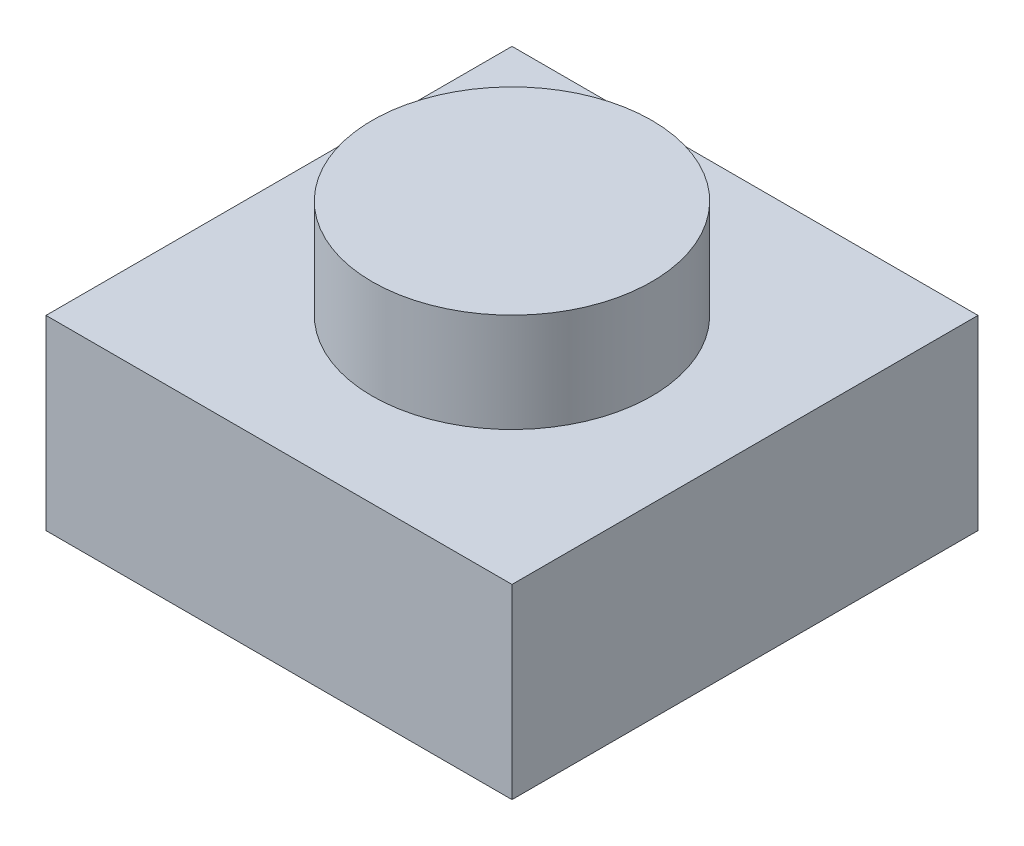
ISO-10303-21;
HEADER;
FILE_DESCRIPTION(('STEP AP214'),'2;1');
FILE_NAME('part.step','',(''),(''),'','','');
FILE_SCHEMA(('AUTOMOTIVE_DESIGN { 1 0 10303 214 1 1 1 1 }'));
ENDSEC;
DATA;
#1=APPLICATION_CONTEXT('core data for automotive mechanical design processes');
#2=APPLICATION_PROTOCOL_DEFINITION('international standard','automotive_design',2000,#1);
#3=PRODUCT_CONTEXT('',#1,'mechanical');
#4=PRODUCT('Part','Part','',(#3));
#5=PRODUCT_RELATED_PRODUCT_CATEGORY('part','',(#4));
#6=PRODUCT_DEFINITION_FORMATION('','',#4);
#7=PRODUCT_DEFINITION_CONTEXT('part definition',#1,'design');
#8=PRODUCT_DEFINITION('design','',#6,#7);
#9=PRODUCT_DEFINITION_SHAPE('','',#8);
#10=(LENGTH_UNIT() NAMED_UNIT(*) SI_UNIT(.MILLI.,.METRE.));
#11=(NAMED_UNIT(*) PLANE_ANGLE_UNIT() SI_UNIT($,.RADIAN.));
#12=(NAMED_UNIT(*) SI_UNIT($,.STERADIAN.) SOLID_ANGLE_UNIT());
#13=UNCERTAINTY_MEASURE_WITH_UNIT(LENGTH_MEASURE(1.E-05),#10,'distance_accuracy_value','');
#14=(GEOMETRIC_REPRESENTATION_CONTEXT(3) GLOBAL_UNCERTAINTY_ASSIGNED_CONTEXT((#13)) GLOBAL_UNIT_ASSIGNED_CONTEXT((#10,
#11,#12)) REPRESENTATION_CONTEXT('',''));
#15=CARTESIAN_POINT('',(0.,0.,0.));
#16=DIRECTION('',(0.,0.,1.));
#17=DIRECTION('',(1.,0.,0.));
#18=AXIS2_PLACEMENT_3D('',#15,#16,#17);
#19=CARTESIAN_POINT('',(0.,0.,0.));
#20=DIRECTION('',(0.,-1.,0.));
#21=DIRECTION('',(0.,0.,-1.));
#22=AXIS2_PLACEMENT_3D('',#19,#20,#21);
#23=PLANE('',#22);
#24=DIRECTION('',(0.,0.,-1.));
#25=VECTOR('',#24,1.);
#26=CARTESIAN_POINT('',(4.,0.,4.));
#27=LINE('',#26,#25);
#28=CARTESIAN_POINT('',(4.,0.,4.));
#29=VERTEX_POINT('',#28);
#30=CARTESIAN_POINT('',(4.,0.,-4.));
#31=VERTEX_POINT('',#30);
#32=EDGE_CURVE('E156',#29,#31,#27,.T.);
#33=ORIENTED_EDGE('',*,*,#32,.F.);
#34=DIRECTION('',(1.,0.,0.));
#35=VECTOR('',#34,1.);
#36=CARTESIAN_POINT('',(-4.,0.,4.));
#37=LINE('',#36,#35);
#38=CARTESIAN_POINT('',(-4.,0.,4.));
#39=VERTEX_POINT('',#38);
#40=EDGE_CURVE('E79',#39,#29,#37,.T.);
#41=ORIENTED_EDGE('',*,*,#40,.F.);
#42=DIRECTION('',(0.,0.,1.));
#43=VECTOR('',#42,1.);
#44=CARTESIAN_POINT('',(-4.,0.,4.));
#45=LINE('',#44,#43);
#46=CARTESIAN_POINT('',(-4.,0.,-4.));
#47=VERTEX_POINT('',#46);
#48=EDGE_CURVE('E169',#47,#39,#45,.T.);
#49=ORIENTED_EDGE('',*,*,#48,.F.);
#50=DIRECTION('',(-1.,0.,0.));
#51=VECTOR('',#50,1.);
#52=CARTESIAN_POINT('',(-4.,0.,-4.));
#53=LINE('',#52,#51);
#54=EDGE_CURVE('E167',#31,#47,#53,.T.);
#55=ORIENTED_EDGE('',*,*,#54,.F.);
#56=EDGE_LOOP('',(#33,#41,#49,#55));
#57=FACE_BOUND('',#56,.T.);
#58=DIRECTION('',(1.,0.,0.));
#59=VECTOR('',#58,1.);
#60=CARTESIAN_POINT('',(0.,0.,2.4));
#61=LINE('',#60,#59);
#62=CARTESIAN_POINT('',(-2.4,0.,2.4));
#63=VERTEX_POINT('',#62);
#64=CARTESIAN_POINT('',(2.4,0.,2.4));
#65=VERTEX_POINT('',#64);
#66=EDGE_CURVE('E127',#63,#65,#61,.T.);
#67=ORIENTED_EDGE('',*,*,#66,.T.);
#68=DIRECTION('',(0.,0.,-1.));
#69=VECTOR('',#68,1.);
#70=CARTESIAN_POINT('',(2.4,0.,0.));
#71=LINE('',#70,#69);
#72=CARTESIAN_POINT('',(2.4,0.,-2.4));
#73=VERTEX_POINT('',#72);
#74=EDGE_CURVE('E149',#65,#73,#71,.T.);
#75=ORIENTED_EDGE('',*,*,#74,.T.);
#76=DIRECTION('',(-1.,0.,0.));
#77=VECTOR('',#76,1.);
#78=CARTESIAN_POINT('',(0.,0.,-2.4));
#79=LINE('',#78,#77);
#80=CARTESIAN_POINT('',(-2.4,0.,-2.4));
#81=VERTEX_POINT('',#80);
#82=EDGE_CURVE('E131',#73,#81,#79,.T.);
#83=ORIENTED_EDGE('',*,*,#82,.T.);
#84=DIRECTION('',(0.,0.,1.));
#85=VECTOR('',#84,1.);
#86=CARTESIAN_POINT('',(-2.4,0.,0.));
#87=LINE('',#86,#85);
#88=EDGE_CURVE('E49',#81,#63,#87,.T.);
#89=ORIENTED_EDGE('',*,*,#88,.T.);
#90=EDGE_LOOP('',(#67,#75,#83,#89));
#91=FACE_BOUND('',#90,.T.);
#92=ADVANCED_FACE('F33',(#57,#91),#23,.T.);
#93=CARTESIAN_POINT('',(4.,3.2,4.));
#94=DIRECTION('',(-1.,0.,0.));
#95=DIRECTION('',(0.,0.,1.));
#96=AXIS2_PLACEMENT_3D('',#93,#94,#95);
#97=PLANE('',#96);
#98=ORIENTED_EDGE('',*,*,#32,.T.);
#99=DIRECTION('',(0.,-1.,0.));
#100=VECTOR('',#99,1.);
#101=CARTESIAN_POINT('',(4.,3.2,-4.));
#102=LINE('',#101,#100);
#103=CARTESIAN_POINT('',(4.,3.2,-4.));
#104=VERTEX_POINT('',#103);
#105=EDGE_CURVE('E37',#104,#31,#102,.T.);
#106=ORIENTED_EDGE('',*,*,#105,.F.);
#107=DIRECTION('',(0.,0.,-1.));
#108=VECTOR('',#107,1.);
#109=CARTESIAN_POINT('',(4.,3.2,4.));
#110=LINE('',#109,#108);
#111=CARTESIAN_POINT('',(4.,3.2,4.));
#112=VERTEX_POINT('',#111);
#113=EDGE_CURVE('E158',#112,#104,#110,.T.);
#114=ORIENTED_EDGE('',*,*,#113,.F.);
#115=DIRECTION('',(0.,-1.,0.));
#116=VECTOR('',#115,1.);
#117=CARTESIAN_POINT('',(4.,3.2,4.));
#118=LINE('',#117,#116);
#119=EDGE_CURVE('E164',#112,#29,#118,.T.);
#120=ORIENTED_EDGE('',*,*,#119,.T.);
#121=EDGE_LOOP('',(#98,#106,#114,#120));
#122=FACE_BOUND('',#121,.T.);
#123=ADVANCED_FACE('F35',(#122),#97,.F.);
#124=CARTESIAN_POINT('',(-4.,3.2,-4.));
#125=DIRECTION('',(0.,0.,1.));
#126=DIRECTION('',(1.,0.,0.));
#127=AXIS2_PLACEMENT_3D('',#124,#125,#126);
#128=PLANE('',#127);
#129=ORIENTED_EDGE('',*,*,#54,.T.);
#130=DIRECTION('',(0.,-1.,0.));
#131=VECTOR('',#130,1.);
#132=CARTESIAN_POINT('',(-4.,3.2,-4.));
#133=LINE('',#132,#131);
#134=CARTESIAN_POINT('',(-4.,3.2,-4.));
#135=VERTEX_POINT('',#134);
#136=EDGE_CURVE('E174',#135,#47,#133,.T.);
#137=ORIENTED_EDGE('',*,*,#136,.F.);
#138=DIRECTION('',(-1.,0.,0.));
#139=VECTOR('',#138,1.);
#140=CARTESIAN_POINT('',(-4.,3.2,-4.));
#141=LINE('',#140,#139);
#142=EDGE_CURVE('E87',#104,#135,#141,.T.);
#143=ORIENTED_EDGE('',*,*,#142,.F.);
#144=ORIENTED_EDGE('',*,*,#105,.T.);
#145=EDGE_LOOP('',(#129,#137,#143,#144));
#146=FACE_BOUND('',#145,.T.);
#147=ADVANCED_FACE('F180',(#146),#128,.F.);
#148=CARTESIAN_POINT('',(-4.,3.2,4.));
#149=DIRECTION('',(1.,0.,0.));
#150=DIRECTION('',(0.,0.,-1.));
#151=AXIS2_PLACEMENT_3D('',#148,#149,#150);
#152=PLANE('',#151);
#153=ORIENTED_EDGE('',*,*,#48,.T.);
#154=DIRECTION('',(0.,-1.,0.));
#155=VECTOR('',#154,1.);
#156=CARTESIAN_POINT('',(-4.,3.2,4.));
#157=LINE('',#156,#155);
#158=CARTESIAN_POINT('',(-4.,3.2,4.));
#159=VERTEX_POINT('',#158);
#160=EDGE_CURVE('E173',#159,#39,#157,.T.);
#161=ORIENTED_EDGE('',*,*,#160,.F.);
#162=DIRECTION('',(0.,0.,1.));
#163=VECTOR('',#162,1.);
#164=CARTESIAN_POINT('',(-4.,3.2,4.));
#165=LINE('',#164,#163);
#166=EDGE_CURVE('E161',#135,#159,#165,.T.);
#167=ORIENTED_EDGE('',*,*,#166,.F.);
#168=ORIENTED_EDGE('',*,*,#136,.T.);
#169=EDGE_LOOP('',(#153,#161,#167,#168));
#170=FACE_BOUND('',#169,.T.);
#171=ADVANCED_FACE('F187',(#170),#152,.F.);
#172=CARTESIAN_POINT('',(-4.,3.2,4.));
#173=DIRECTION('',(0.,0.,-1.));
#174=DIRECTION('',(-1.,0.,0.));
#175=AXIS2_PLACEMENT_3D('',#172,#173,#174);
#176=PLANE('',#175);
#177=ORIENTED_EDGE('',*,*,#40,.T.);
#178=ORIENTED_EDGE('',*,*,#119,.F.);
#179=DIRECTION('',(1.,0.,0.));
#180=VECTOR('',#179,1.);
#181=CARTESIAN_POINT('',(-4.,3.2,4.));
#182=LINE('',#181,#180);
#183=EDGE_CURVE('E58',#159,#112,#182,.T.);
#184=ORIENTED_EDGE('',*,*,#183,.F.);
#185=ORIENTED_EDGE('',*,*,#160,.T.);
#186=EDGE_LOOP('',(#177,#178,#184,#185));
#187=FACE_BOUND('',#186,.T.);
#188=ADVANCED_FACE('F188',(#187),#176,.F.);
#189=CARTESIAN_POINT('',(0.,3.2,0.));
#190=DIRECTION('',(0.,-1.,0.));
#191=DIRECTION('',(0.,0.,-1.));
#192=AXIS2_PLACEMENT_3D('',#189,#190,#191);
#193=PLANE('',#192);
#194=CARTESIAN_POINT('',(0.,3.2,0.));
#195=DIRECTION('',(0.,1.,0.));
#196=DIRECTION('',(0.,0.,1.));
#197=AXIS2_PLACEMENT_3D('',#194,#195,#196);
#198=CIRCLE('',#197,2.4);
#199=CARTESIAN_POINT('',(0.,3.2,2.4));
#200=VERTEX_POINT('',#199);
#201=EDGE_CURVE('E11',#200,#200,#198,.T.);
#202=ORIENTED_EDGE('',*,*,#201,.F.);
#203=EDGE_LOOP('',(#202));
#204=FACE_BOUND('',#203,.T.);
#205=ORIENTED_EDGE('',*,*,#113,.T.);
#206=ORIENTED_EDGE('',*,*,#142,.T.);
#207=ORIENTED_EDGE('',*,*,#166,.T.);
#208=ORIENTED_EDGE('',*,*,#183,.T.);
#209=EDGE_LOOP('',(#205,#206,#207,#208));
#210=FACE_BOUND('',#209,.T.);
#211=ADVANCED_FACE('F189',(#204,#210),#193,.F.);
#212=CARTESIAN_POINT('',(0.,4.9,0.));
#213=DIRECTION('',(0.,-1.,0.));
#214=DIRECTION('',(0.,0.,-1.));
#215=AXIS2_PLACEMENT_3D('',#212,#213,#214);
#216=CYLINDRICAL_SURFACE('',#215,2.4);
#217=CARTESIAN_POINT('',(0.,4.9,0.));
#218=DIRECTION('',(0.,1.,0.));
#219=DIRECTION('',(0.,0.,1.));
#220=AXIS2_PLACEMENT_3D('',#217,#218,#219);
#221=CIRCLE('',#220,2.4);
#222=CARTESIAN_POINT('',(0.,4.9,2.4));
#223=VERTEX_POINT('',#222);
#224=EDGE_CURVE('E136',#223,#223,#221,.T.);
#225=ORIENTED_EDGE('',*,*,#224,.F.);
#226=EDGE_LOOP('',(#225));
#227=FACE_BOUND('',#226,.T.);
#228=ORIENTED_EDGE('',*,*,#201,.T.);
#229=EDGE_LOOP('',(#228));
#230=FACE_BOUND('',#229,.T.);
#231=ADVANCED_FACE('F191',(#227,#230),#216,.T.);
#232=CARTESIAN_POINT('',(0.,4.9,0.));
#233=DIRECTION('',(0.,1.,0.));
#234=DIRECTION('',(0.,0.,1.));
#235=AXIS2_PLACEMENT_3D('',#232,#233,#234);
#236=PLANE('',#235);
#237=ORIENTED_EDGE('',*,*,#224,.T.);
#238=EDGE_LOOP('',(#237));
#239=FACE_BOUND('',#238,.T.);
#240=ADVANCED_FACE('F198',(#239),#236,.T.);
#241=CARTESIAN_POINT('',(2.4,3.2,4.));
#242=DIRECTION('',(-1.,0.,0.));
#243=DIRECTION('',(0.,0.,1.));
#244=AXIS2_PLACEMENT_3D('',#241,#242,#243);
#245=PLANE('',#244);
#246=ORIENTED_EDGE('',*,*,#74,.F.);
#247=DIRECTION('',(0.,-1.,0.));
#248=VECTOR('',#247,1.);
#249=CARTESIAN_POINT('',(2.4,3.2,2.4));
#250=LINE('',#249,#248);
#251=CARTESIAN_POINT('',(2.4,1.6,2.4));
#252=VERTEX_POINT('',#251);
#253=EDGE_CURVE('E126',#252,#65,#250,.T.);
#254=ORIENTED_EDGE('',*,*,#253,.F.);
#255=DIRECTION('',(0.,0.,-1.));
#256=VECTOR('',#255,1.);
#257=CARTESIAN_POINT('',(2.4,1.6,0.));
#258=LINE('',#257,#256);
#259=CARTESIAN_POINT('',(2.4,1.6,-2.4));
#260=VERTEX_POINT('',#259);
#261=EDGE_CURVE('E114',#252,#260,#258,.T.);
#262=ORIENTED_EDGE('',*,*,#261,.T.);
#263=DIRECTION('',(0.,-1.,0.));
#264=VECTOR('',#263,1.);
#265=CARTESIAN_POINT('',(2.4,3.2,-2.4));
#266=LINE('',#265,#264);
#267=EDGE_CURVE('E124',#260,#73,#266,.T.);
#268=ORIENTED_EDGE('',*,*,#267,.T.);
#269=EDGE_LOOP('',(#246,#254,#262,#268));
#270=FACE_BOUND('',#269,.T.);
#271=ADVANCED_FACE('F123',(#270),#245,.T.);
#272=CARTESIAN_POINT('',(-4.,3.2,-2.4));
#273=DIRECTION('',(0.,0.,1.));
#274=DIRECTION('',(1.,0.,0.));
#275=AXIS2_PLACEMENT_3D('',#272,#273,#274);
#276=PLANE('',#275);
#277=ORIENTED_EDGE('',*,*,#82,.F.);
#278=ORIENTED_EDGE('',*,*,#267,.F.);
#279=DIRECTION('',(-1.,0.,0.));
#280=VECTOR('',#279,1.);
#281=CARTESIAN_POINT('',(0.,1.6,-2.4));
#282=LINE('',#281,#280);
#283=CARTESIAN_POINT('',(-2.4,1.6,-2.4));
#284=VERTEX_POINT('',#283);
#285=EDGE_CURVE('E110',#260,#284,#282,.T.);
#286=ORIENTED_EDGE('',*,*,#285,.T.);
#287=DIRECTION('',(0.,-1.,0.));
#288=VECTOR('',#287,1.);
#289=CARTESIAN_POINT('',(-2.4,3.2,-2.4));
#290=LINE('',#289,#288);
#291=EDGE_CURVE('E133',#284,#81,#290,.T.);
#292=ORIENTED_EDGE('',*,*,#291,.T.);
#293=EDGE_LOOP('',(#277,#278,#286,#292));
#294=FACE_BOUND('',#293,.T.);
#295=ADVANCED_FACE('F129',(#294),#276,.T.);
#296=CARTESIAN_POINT('',(-2.4,3.2,4.));
#297=DIRECTION('',(1.,0.,0.));
#298=DIRECTION('',(0.,0.,-1.));
#299=AXIS2_PLACEMENT_3D('',#296,#297,#298);
#300=PLANE('',#299);
#301=ORIENTED_EDGE('',*,*,#88,.F.);
#302=ORIENTED_EDGE('',*,*,#291,.F.);
#303=DIRECTION('',(0.,0.,1.));
#304=VECTOR('',#303,1.);
#305=CARTESIAN_POINT('',(-2.4,1.6,0.));
#306=LINE('',#305,#304);
#307=CARTESIAN_POINT('',(-2.4,1.6,2.4));
#308=VERTEX_POINT('',#307);
#309=EDGE_CURVE('E115',#284,#308,#306,.T.);
#310=ORIENTED_EDGE('',*,*,#309,.T.);
#311=DIRECTION('',(0.,-1.,0.));
#312=VECTOR('',#311,1.);
#313=CARTESIAN_POINT('',(-2.4,3.2,2.4));
#314=LINE('',#313,#312);
#315=EDGE_CURVE('E138',#308,#63,#314,.T.);
#316=ORIENTED_EDGE('',*,*,#315,.T.);
#317=EDGE_LOOP('',(#301,#302,#310,#316));
#318=FACE_BOUND('',#317,.T.);
#319=ADVANCED_FACE('F263',(#318),#300,.T.);
#320=CARTESIAN_POINT('',(-4.,3.2,2.4));
#321=DIRECTION('',(0.,0.,-1.));
#322=DIRECTION('',(-1.,0.,0.));
#323=AXIS2_PLACEMENT_3D('',#320,#321,#322);
#324=PLANE('',#323);
#325=ORIENTED_EDGE('',*,*,#66,.F.);
#326=ORIENTED_EDGE('',*,*,#315,.F.);
#327=DIRECTION('',(1.,0.,0.));
#328=VECTOR('',#327,1.);
#329=CARTESIAN_POINT('',(0.,1.6,2.4));
#330=LINE('',#329,#328);
#331=EDGE_CURVE('E141',#308,#252,#330,.T.);
#332=ORIENTED_EDGE('',*,*,#331,.T.);
#333=ORIENTED_EDGE('',*,*,#253,.T.);
#334=EDGE_LOOP('',(#325,#326,#332,#333));
#335=FACE_BOUND('',#334,.T.);
#336=ADVANCED_FACE('F272',(#335),#324,.T.);
#337=CARTESIAN_POINT('',(0.,1.6,0.));
#338=DIRECTION('',(0.,-1.,0.));
#339=DIRECTION('',(0.,0.,-1.));
#340=AXIS2_PLACEMENT_3D('',#337,#338,#339);
#341=PLANE('',#340);
#342=CARTESIAN_POINT('',(0.,1.6,0.));
#343=DIRECTION('',(0.,-1.,0.));
#344=DIRECTION('',(0.,0.,-1.));
#345=AXIS2_PLACEMENT_3D('',#342,#343,#344);
#346=CIRCLE('',#345,0.8);
#347=CARTESIAN_POINT('',(0.,1.6,-0.8));
#348=VERTEX_POINT('',#347);
#349=EDGE_CURVE('E132',#348,#348,#346,.F.);
#350=ORIENTED_EDGE('',*,*,#349,.T.);
#351=EDGE_LOOP('',(#350));
#352=FACE_BOUND('',#351,.T.);
#353=ORIENTED_EDGE('',*,*,#261,.F.);
#354=ORIENTED_EDGE('',*,*,#331,.F.);
#355=ORIENTED_EDGE('',*,*,#309,.F.);
#356=ORIENTED_EDGE('',*,*,#285,.F.);
#357=EDGE_LOOP('',(#353,#354,#355,#356));
#358=FACE_BOUND('',#357,.T.);
#359=ADVANCED_FACE('F112',(#352,#358),#341,.T.);
#360=CARTESIAN_POINT('',(0.,4.9,0.));
#361=DIRECTION('',(0.,-1.,0.));
#362=DIRECTION('',(0.,0.,-1.));
#363=AXIS2_PLACEMENT_3D('',#360,#361,#362);
#364=CYLINDRICAL_SURFACE('',#363,0.8);
#365=CARTESIAN_POINT('',(0.,3.3,0.));
#366=DIRECTION('',(0.,1.,0.));
#367=DIRECTION('',(0.,0.,1.));
#368=AXIS2_PLACEMENT_3D('',#365,#366,#367);
#369=CIRCLE('',#368,0.8);
#370=CARTESIAN_POINT('',(0.,3.3,0.8));
#371=VERTEX_POINT('',#370);
#372=EDGE_CURVE('E146',#371,#371,#369,.T.);
#373=ORIENTED_EDGE('',*,*,#372,.T.);
#374=EDGE_LOOP('',(#373));
#375=FACE_BOUND('',#374,.T.);
#376=ORIENTED_EDGE('',*,*,#349,.F.);
#377=EDGE_LOOP('',(#376));
#378=FACE_BOUND('',#377,.T.);
#379=ADVANCED_FACE('F290',(#375,#378),#364,.F.);
#380=CARTESIAN_POINT('',(0.,3.3,0.));
#381=DIRECTION('',(0.,1.,0.));
#382=DIRECTION('',(0.,0.,1.));
#383=AXIS2_PLACEMENT_3D('',#380,#381,#382);
#384=PLANE('',#383);
#385=ORIENTED_EDGE('',*,*,#372,.F.);
#386=EDGE_LOOP('',(#385));
#387=FACE_BOUND('',#386,.T.);
#388=ADVANCED_FACE('F300',(#387),#384,.F.);
#389=CLOSED_SHELL('',(#92,#123,#147,#171,#188,#211,#231,#240,#271,#295,#319,#336,#359,#379,#388));
#390=MANIFOLD_SOLID_BREP('B2',#389);
#391=ADVANCED_BREP_SHAPE_REPRESENTATION('',(#18,#390),#14);
#392=SHAPE_DEFINITION_REPRESENTATION(#9,#391);
ENDSEC;
END-ISO-10303-21;
